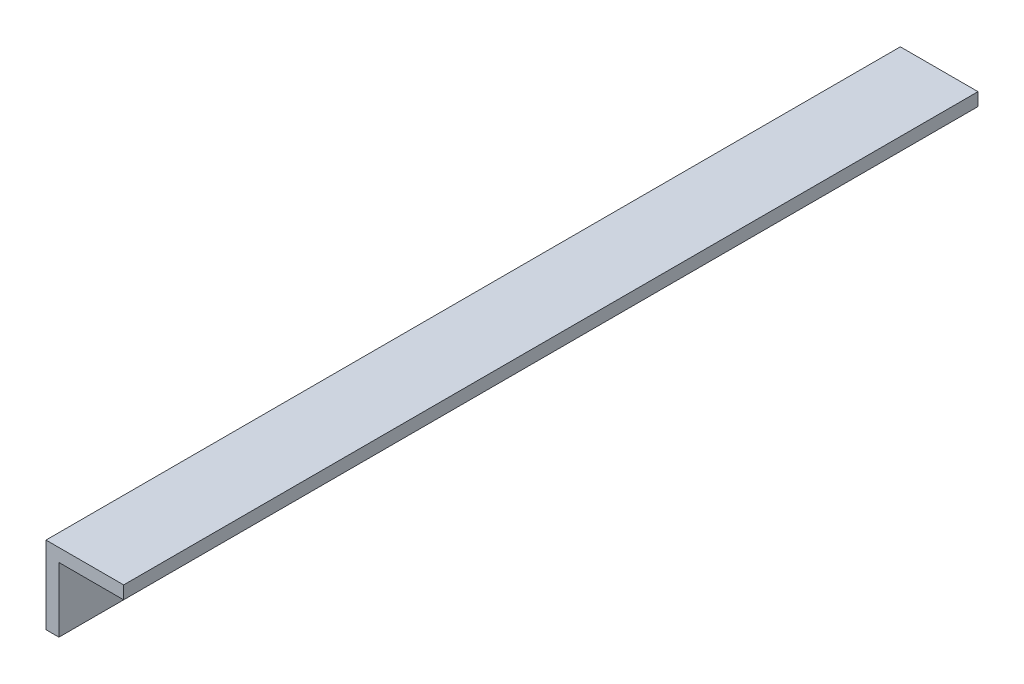
ISO-10303-21;
HEADER;
FILE_DESCRIPTION(('STEP AP214'),'2;1');
FILE_NAME('part.step','',(''),(''),'','','');
FILE_SCHEMA(('AUTOMOTIVE_DESIGN { 1 0 10303 214 1 1 1 1 }'));
ENDSEC;
DATA;
#1=APPLICATION_CONTEXT('core data for automotive mechanical design processes');
#2=APPLICATION_PROTOCOL_DEFINITION('international standard','automotive_design',2000,#1);
#3=PRODUCT_CONTEXT('',#1,'mechanical');
#4=PRODUCT('Part','Part','',(#3));
#5=PRODUCT_RELATED_PRODUCT_CATEGORY('part','',(#4));
#6=PRODUCT_DEFINITION_FORMATION('','',#4);
#7=PRODUCT_DEFINITION_CONTEXT('part definition',#1,'design');
#8=PRODUCT_DEFINITION('design','',#6,#7);
#9=PRODUCT_DEFINITION_SHAPE('','',#8);
#10=(LENGTH_UNIT() NAMED_UNIT(*) SI_UNIT(.MILLI.,.METRE.));
#11=(NAMED_UNIT(*) PLANE_ANGLE_UNIT() SI_UNIT($,.RADIAN.));
#12=(NAMED_UNIT(*) SI_UNIT($,.STERADIAN.) SOLID_ANGLE_UNIT());
#13=UNCERTAINTY_MEASURE_WITH_UNIT(LENGTH_MEASURE(1.E-05),#10,'distance_accuracy_value','');
#14=(GEOMETRIC_REPRESENTATION_CONTEXT(3) GLOBAL_UNCERTAINTY_ASSIGNED_CONTEXT((#13)) GLOBAL_UNIT_ASSIGNED_CONTEXT((#10,
#11,#12)) REPRESENTATION_CONTEXT('',''));
#15=CARTESIAN_POINT('',(0.,0.,0.));
#16=DIRECTION('',(0.,0.,1.));
#17=DIRECTION('',(1.,0.,0.));
#18=AXIS2_PLACEMENT_3D('',#15,#16,#17);
#19=CARTESIAN_POINT('',(269.875000000007,946.300000000016,269.781536726421));
#20=DIRECTION('',(1.00000000000001,0.,0.));
#21=DIRECTION('',(0.,0.,1.));
#22=AXIS2_PLACEMENT_3D('',#19,#20,#21);
#23=PLANE('',#22);
#24=CARTESIAN_POINT('',(269.875000000007,962.175000000017,71.8088744611157));
#25=DIRECTION('',(-1.00000000000001,0.,0.));
#26=DIRECTION('',(0.,0.,1.));
#27=AXIS2_PLACEMENT_3D('',#24,#25,#26);
#28=CIRCLE('',#27,6.34999999999997);
#29=CARTESIAN_POINT('',(269.875000000007,962.175000000017,78.1588744611157));
#30=VERTEX_POINT('',#29);
#31=EDGE_CURVE('E280',#30,#30,#28,.T.);
#32=ORIENTED_EDGE('',*,*,#31,.F.);
#33=EDGE_LOOP('',(#32));
#34=FACE_BOUND('',#33,.T.);
#35=CARTESIAN_POINT('',(269.875000000007,962.175000000017,109.908874461116));
#36=DIRECTION('',(-1.00000000000001,0.,0.));
#37=DIRECTION('',(0.,0.,1.));
#38=AXIS2_PLACEMENT_3D('',#35,#36,#37);
#39=CIRCLE('',#38,6.35000000000006);
#40=CARTESIAN_POINT('',(269.875000000007,962.175000000017,116.258874461116));
#41=VERTEX_POINT('',#40);
#42=EDGE_CURVE('E114',#41,#41,#39,.T.);
#43=ORIENTED_EDGE('',*,*,#42,.F.);
#44=EDGE_LOOP('',(#43));
#45=FACE_BOUND('',#44,.T.);
#46=DIRECTION('',(0.,0.,-1.));
#47=VECTOR('',#46,1.);
#48=CARTESIAN_POINT('',(269.875000000007,984.400000000019,269.781536726421));
#49=LINE('',#48,#47);
#50=CARTESIAN_POINT('',(269.875000000007,984.400000000016,215.900000000006));
#51=VERTEX_POINT('',#50);
#52=CARTESIAN_POINT('',(269.875000000007,984.400000000016,-203.199999999994));
#53=VERTEX_POINT('',#52);
#54=EDGE_CURVE('E147',#51,#53,#49,.T.);
#55=ORIENTED_EDGE('',*,*,#54,.T.);
#56=DIRECTION('',(0.,-1.00000000000001,0.));
#57=VECTOR('',#56,1.);
#58=CARTESIAN_POINT('',(269.87500000001,946.300000000016,-203.199999999994));
#59=LINE('',#58,#57);
#60=CARTESIAN_POINT('',(269.87500000001,946.300000000016,-203.199999999994));
#61=VERTEX_POINT('',#60);
#62=EDGE_CURVE('E142',#53,#61,#59,.T.);
#63=ORIENTED_EDGE('',*,*,#62,.T.);
#64=DIRECTION('',(0.,0.,-1.));
#65=VECTOR('',#64,1.);
#66=CARTESIAN_POINT('',(269.875000000007,946.300000000016,269.781536726421));
#67=LINE('',#66,#65);
#68=CARTESIAN_POINT('',(269.875000000007,946.300000000016,215.900000000006));
#69=VERTEX_POINT('',#68);
#70=EDGE_CURVE('E162',#69,#61,#67,.T.);
#71=ORIENTED_EDGE('',*,*,#70,.F.);
#72=DIRECTION('',(0.,-1.00000000000001,0.));
#73=VECTOR('',#72,1.);
#74=CARTESIAN_POINT('',(269.875000000007,946.300000000016,215.900000000006));
#75=LINE('',#74,#73);
#76=EDGE_CURVE('E45',#51,#69,#75,.T.);
#77=ORIENTED_EDGE('',*,*,#76,.F.);
#78=EDGE_LOOP('',(#55,#63,#71,#77));
#79=FACE_BOUND('',#78,.T.);
#80=ADVANCED_FACE('F41',(#34,#45,#79),#23,.F.);
#81=CARTESIAN_POINT('',(269.875000000007,946.300000000016,269.781536726421));
#82=DIRECTION('',(0.,-1.00000000000001,0.));
#83=DIRECTION('',(0.,0.,-1.));
#84=AXIS2_PLACEMENT_3D('',#81,#82,#83);
#85=PLANE('',#84);
#86=DIRECTION('',(-1.00000000000001,0.,0.));
#87=VECTOR('',#86,1.);
#88=CARTESIAN_POINT('',(269.875000000007,946.300000000016,215.900000000006));
#89=LINE('',#88,#87);
#90=CARTESIAN_POINT('',(276.225000000007,946.300000000016,215.900000000006));
#91=VERTEX_POINT('',#90);
#92=EDGE_CURVE('E149',#91,#69,#89,.T.);
#93=ORIENTED_EDGE('',*,*,#92,.T.);
#94=ORIENTED_EDGE('',*,*,#70,.T.);
#95=DIRECTION('',(-1.00000000000001,0.,0.));
#96=VECTOR('',#95,1.);
#97=CARTESIAN_POINT('',(269.87500000001,946.300000000016,-203.199999999994));
#98=LINE('',#97,#96);
#99=CARTESIAN_POINT('',(276.22500000001,946.300000000016,-203.199999999994));
#100=VERTEX_POINT('',#99);
#101=EDGE_CURVE('E134',#100,#61,#98,.T.);
#102=ORIENTED_EDGE('',*,*,#101,.F.);
#103=DIRECTION('',(0.,0.,-1.));
#104=VECTOR('',#103,1.);
#105=CARTESIAN_POINT('',(276.225000000007,946.300000000016,269.781536726421));
#106=LINE('',#105,#104);
#107=EDGE_CURVE('E166',#91,#100,#106,.T.);
#108=ORIENTED_EDGE('',*,*,#107,.F.);
#109=EDGE_LOOP('',(#93,#94,#102,#108));
#110=FACE_BOUND('',#109,.T.);
#111=ADVANCED_FACE('F183',(#110),#85,.T.);
#112=CARTESIAN_POINT('',(276.225000000007,946.300000000016,269.781536726421));
#113=DIRECTION('',(1.00000000000001,0.,0.));
#114=DIRECTION('',(0.,0.,1.));
#115=AXIS2_PLACEMENT_3D('',#112,#113,#114);
#116=PLANE('',#115);
#117=CARTESIAN_POINT('',(276.225000000007,962.175000000017,71.8088744611157));
#118=DIRECTION('',(-1.00000000000001,0.,0.));
#119=DIRECTION('',(0.,0.,1.));
#120=AXIS2_PLACEMENT_3D('',#117,#118,#119);
#121=CIRCLE('',#120,6.34999999999997);
#122=CARTESIAN_POINT('',(276.225000000007,962.175000000017,78.1588744611157));
#123=VERTEX_POINT('',#122);
#124=EDGE_CURVE('E283',#123,#123,#121,.T.);
#125=ORIENTED_EDGE('',*,*,#124,.T.);
#126=EDGE_LOOP('',(#125));
#127=FACE_BOUND('',#126,.T.);
#128=CARTESIAN_POINT('',(276.225000000007,962.175000000017,109.908874461116));
#129=DIRECTION('',(-1.00000000000001,0.,0.));
#130=DIRECTION('',(0.,0.,1.));
#131=AXIS2_PLACEMENT_3D('',#128,#129,#130);
#132=CIRCLE('',#131,6.35000000000006);
#133=CARTESIAN_POINT('',(276.225000000007,962.175000000017,116.258874461116));
#134=VERTEX_POINT('',#133);
#135=EDGE_CURVE('E137',#134,#134,#132,.T.);
#136=ORIENTED_EDGE('',*,*,#135,.T.);
#137=EDGE_LOOP('',(#136));
#138=FACE_BOUND('',#137,.T.);
#139=DIRECTION('',(0.,-1.00000000000001,0.));
#140=VECTOR('',#139,1.);
#141=CARTESIAN_POINT('',(276.225000000007,946.300000000016,215.900000000006));
#142=LINE('',#141,#140);
#143=CARTESIAN_POINT('',(276.225000000007,978.050000000016,215.900000000006));
#144=VERTEX_POINT('',#143);
#145=EDGE_CURVE('E64',#144,#91,#142,.T.);
#146=ORIENTED_EDGE('',*,*,#145,.T.);
#147=ORIENTED_EDGE('',*,*,#107,.T.);
#148=DIRECTION('',(0.,-1.00000000000001,0.));
#149=VECTOR('',#148,1.);
#150=CARTESIAN_POINT('',(276.22500000001,946.300000000016,-203.199999999994));
#151=LINE('',#150,#149);
#152=CARTESIAN_POINT('',(276.225000000007,978.050000000016,-203.199999999994));
#153=VERTEX_POINT('',#152);
#154=EDGE_CURVE('E130',#153,#100,#151,.T.);
#155=ORIENTED_EDGE('',*,*,#154,.F.);
#156=DIRECTION('',(0.,0.,-1.));
#157=VECTOR('',#156,1.);
#158=CARTESIAN_POINT('',(276.225000000007,978.050000000019,269.781536726421));
#159=LINE('',#158,#157);
#160=EDGE_CURVE('E125',#144,#153,#159,.T.);
#161=ORIENTED_EDGE('',*,*,#160,.F.);
#162=EDGE_LOOP('',(#146,#147,#155,#161));
#163=FACE_BOUND('',#162,.T.);
#164=ADVANCED_FACE('F184',(#127,#138,#163),#116,.T.);
#165=CARTESIAN_POINT('',(269.875000000007,978.050000000019,269.781536726421));
#166=DIRECTION('',(0.,-1.00000000000001,0.));
#167=DIRECTION('',(0.,0.,-1.));
#168=AXIS2_PLACEMENT_3D('',#165,#166,#167);
#169=PLANE('',#168);
#170=DIRECTION('',(-1.00000000000001,0.,0.));
#171=VECTOR('',#170,1.);
#172=CARTESIAN_POINT('',(269.875000000007,978.050000000016,215.900000000006));
#173=LINE('',#172,#171);
#174=CARTESIAN_POINT('',(307.975000000007,978.050000000016,215.900000000006));
#175=VERTEX_POINT('',#174);
#176=EDGE_CURVE('E154',#175,#144,#173,.T.);
#177=ORIENTED_EDGE('',*,*,#176,.T.);
#178=ORIENTED_EDGE('',*,*,#160,.T.);
#179=DIRECTION('',(-1.00000000000001,0.,0.));
#180=VECTOR('',#179,1.);
#181=CARTESIAN_POINT('',(269.875000000007,978.050000000016,-203.199999999994));
#182=LINE('',#181,#180);
#183=CARTESIAN_POINT('',(307.975000000007,978.050000000016,-203.199999999994));
#184=VERTEX_POINT('',#183);
#185=EDGE_CURVE('E106',#184,#153,#182,.T.);
#186=ORIENTED_EDGE('',*,*,#185,.F.);
#187=DIRECTION('',(0.,0.,-1.));
#188=VECTOR('',#187,1.);
#189=CARTESIAN_POINT('',(307.975000000007,978.050000000019,269.781536726421));
#190=LINE('',#189,#188);
#191=EDGE_CURVE('E118',#175,#184,#190,.T.);
#192=ORIENTED_EDGE('',*,*,#191,.F.);
#193=EDGE_LOOP('',(#177,#178,#186,#192));
#194=FACE_BOUND('',#193,.T.);
#195=ADVANCED_FACE('F127',(#194),#169,.T.);
#196=CARTESIAN_POINT('',(307.975000000007,978.050000000019,269.781536726421));
#197=DIRECTION('',(1.00000000000001,0.,0.));
#198=DIRECTION('',(0.,0.,1.));
#199=AXIS2_PLACEMENT_3D('',#196,#197,#198);
#200=PLANE('',#199);
#201=DIRECTION('',(0.,-1.00000000000001,0.));
#202=VECTOR('',#201,1.);
#203=CARTESIAN_POINT('',(307.975000000007,978.050000000016,215.900000000006));
#204=LINE('',#203,#202);
#205=CARTESIAN_POINT('',(307.975000000007,984.400000000016,215.900000000006));
#206=VERTEX_POINT('',#205);
#207=EDGE_CURVE('E52',#206,#175,#204,.T.);
#208=ORIENTED_EDGE('',*,*,#207,.T.);
#209=ORIENTED_EDGE('',*,*,#191,.T.);
#210=DIRECTION('',(0.,-1.00000000000001,0.));
#211=VECTOR('',#210,1.);
#212=CARTESIAN_POINT('',(307.975000000007,978.050000000016,-203.199999999994));
#213=LINE('',#212,#211);
#214=CARTESIAN_POINT('',(307.975000000007,984.400000000016,-203.199999999994));
#215=VERTEX_POINT('',#214);
#216=EDGE_CURVE('E102',#215,#184,#213,.T.);
#217=ORIENTED_EDGE('',*,*,#216,.F.);
#218=DIRECTION('',(0.,0.,-1.));
#219=VECTOR('',#218,1.);
#220=CARTESIAN_POINT('',(307.975000000007,984.400000000019,269.781536726421));
#221=LINE('',#220,#219);
#222=EDGE_CURVE('E124',#206,#215,#221,.T.);
#223=ORIENTED_EDGE('',*,*,#222,.F.);
#224=EDGE_LOOP('',(#208,#209,#217,#223));
#225=FACE_BOUND('',#224,.T.);
#226=ADVANCED_FACE('F119',(#225),#200,.T.);
#227=CARTESIAN_POINT('',(269.875000000007,984.400000000019,269.781536726421));
#228=DIRECTION('',(0.,-1.00000000000001,0.));
#229=DIRECTION('',(0.,0.,-1.));
#230=AXIS2_PLACEMENT_3D('',#227,#228,#229);
#231=PLANE('',#230);
#232=ORIENTED_EDGE('',*,*,#222,.T.);
#233=DIRECTION('',(-1.00000000000001,0.,0.));
#234=VECTOR('',#233,1.);
#235=CARTESIAN_POINT('',(269.875000000007,984.400000000016,-203.199999999994));
#236=LINE('',#235,#234);
#237=EDGE_CURVE('E109',#215,#53,#236,.T.);
#238=ORIENTED_EDGE('',*,*,#237,.T.);
#239=ORIENTED_EDGE('',*,*,#54,.F.);
#240=DIRECTION('',(-1.00000000000001,0.,0.));
#241=VECTOR('',#240,1.);
#242=CARTESIAN_POINT('',(269.875000000007,984.400000000016,215.900000000006));
#243=LINE('',#242,#241);
#244=EDGE_CURVE('E11',#206,#51,#243,.T.);
#245=ORIENTED_EDGE('',*,*,#244,.F.);
#246=EDGE_LOOP('',(#232,#238,#239,#245));
#247=FACE_BOUND('',#246,.T.);
#248=ADVANCED_FACE('F43',(#247),#231,.F.);
#249=CARTESIAN_POINT('',(269.875000000003,190.650000000013,215.9));
#250=DIRECTION('',(0.,0.,-1.));
#251=DIRECTION('',(0.,1.00000000000001,0.));
#252=AXIS2_PLACEMENT_3D('',#249,#250,#251);
#253=PLANE('',#252);
#254=ORIENTED_EDGE('',*,*,#207,.F.);
#255=ORIENTED_EDGE('',*,*,#244,.T.);
#256=ORIENTED_EDGE('',*,*,#76,.T.);
#257=ORIENTED_EDGE('',*,*,#92,.F.);
#258=ORIENTED_EDGE('',*,*,#145,.F.);
#259=ORIENTED_EDGE('',*,*,#176,.F.);
#260=EDGE_LOOP('',(#254,#255,#256,#257,#258,#259));
#261=FACE_BOUND('',#260,.T.);
#262=ADVANCED_FACE('F178',(#261),#253,.F.);
#263=CARTESIAN_POINT('',(269.875000000006,190.650000000007,-203.199999999998));
#264=DIRECTION('',(0.,0.,1.));
#265=DIRECTION('',(0.,-1.00000000000001,0.));
#266=AXIS2_PLACEMENT_3D('',#263,#264,#265);
#267=PLANE('',#266);
#268=ORIENTED_EDGE('',*,*,#237,.F.);
#269=ORIENTED_EDGE('',*,*,#216,.T.);
#270=ORIENTED_EDGE('',*,*,#185,.T.);
#271=ORIENTED_EDGE('',*,*,#154,.T.);
#272=ORIENTED_EDGE('',*,*,#101,.T.);
#273=ORIENTED_EDGE('',*,*,#62,.F.);
#274=EDGE_LOOP('',(#268,#269,#270,#271,#272,#273));
#275=FACE_BOUND('',#274,.T.);
#276=ADVANCED_FACE('F104',(#275),#267,.F.);
#277=CARTESIAN_POINT('',(269.875000000007,962.175000000017,109.908874461116));
#278=DIRECTION('',(1.00000000000001,0.,0.));
#279=DIRECTION('',(0.,0.,1.));
#280=AXIS2_PLACEMENT_3D('',#277,#278,#279);
#281=CYLINDRICAL_SURFACE('',#280,6.35000000000006);
#282=ORIENTED_EDGE('',*,*,#42,.T.);
#283=EDGE_LOOP('',(#282));
#284=FACE_BOUND('',#283,.T.);
#285=ORIENTED_EDGE('',*,*,#135,.F.);
#286=EDGE_LOOP('',(#285));
#287=FACE_BOUND('',#286,.T.);
#288=ADVANCED_FACE('F256',(#284,#287),#281,.F.);
#289=CARTESIAN_POINT('',(269.875000000007,962.175000000017,71.8088744611157));
#290=DIRECTION('',(1.00000000000001,0.,0.));
#291=DIRECTION('',(0.,0.,1.));
#292=AXIS2_PLACEMENT_3D('',#289,#290,#291);
#293=CYLINDRICAL_SURFACE('',#292,6.34999999999997);
#294=ORIENTED_EDGE('',*,*,#31,.T.);
#295=EDGE_LOOP('',(#294));
#296=FACE_BOUND('',#295,.T.);
#297=ORIENTED_EDGE('',*,*,#124,.F.);
#298=EDGE_LOOP('',(#297));
#299=FACE_BOUND('',#298,.T.);
#300=ADVANCED_FACE('F263',(#296,#299),#293,.F.);
#301=CLOSED_SHELL('',(#80,#111,#164,#195,#226,#248,#262,#276,#288,#300));
#302=MANIFOLD_SOLID_BREP('B2',#301);
#303=ADVANCED_BREP_SHAPE_REPRESENTATION('',(#18,#302),#14);
#304=SHAPE_DEFINITION_REPRESENTATION(#9,#303);
ENDSEC;
END-ISO-10303-21;
